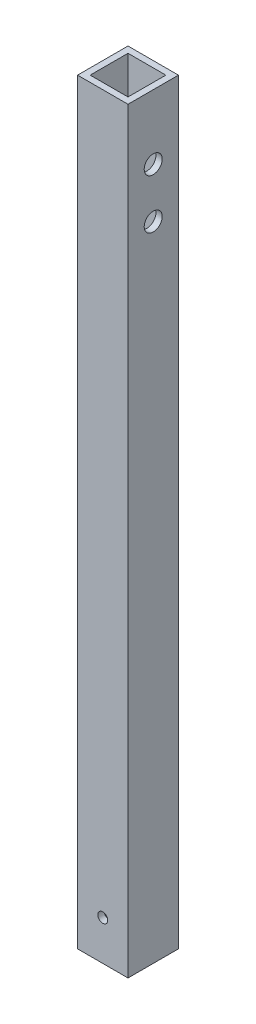
ISO-10303-21;
HEADER;
FILE_DESCRIPTION(('STEP AP214'),'2;1');
FILE_NAME('part.step','',(''),(''),'','','');
FILE_SCHEMA(('AUTOMOTIVE_DESIGN { 1 0 10303 214 1 1 1 1 }'));
ENDSEC;
DATA;
#1=APPLICATION_CONTEXT('core data for automotive mechanical design processes');
#2=APPLICATION_PROTOCOL_DEFINITION('international standard','automotive_design',2000,#1);
#3=PRODUCT_CONTEXT('',#1,'mechanical');
#4=PRODUCT('Part','Part','',(#3));
#5=PRODUCT_RELATED_PRODUCT_CATEGORY('part','',(#4));
#6=PRODUCT_DEFINITION_FORMATION('','',#4);
#7=PRODUCT_DEFINITION_CONTEXT('part definition',#1,'design');
#8=PRODUCT_DEFINITION('design','',#6,#7);
#9=PRODUCT_DEFINITION_SHAPE('','',#8);
#10=(LENGTH_UNIT() NAMED_UNIT(*) SI_UNIT(.MILLI.,.METRE.));
#11=(NAMED_UNIT(*) PLANE_ANGLE_UNIT() SI_UNIT($,.RADIAN.));
#12=(NAMED_UNIT(*) SI_UNIT($,.STERADIAN.) SOLID_ANGLE_UNIT());
#13=UNCERTAINTY_MEASURE_WITH_UNIT(LENGTH_MEASURE(1.E-05),#10,'distance_accuracy_value','');
#14=(GEOMETRIC_REPRESENTATION_CONTEXT(3) GLOBAL_UNCERTAINTY_ASSIGNED_CONTEXT((#13)) GLOBAL_UNIT_ASSIGNED_CONTEXT((#10,
#11,#12)) REPRESENTATION_CONTEXT('',''));
#15=CARTESIAN_POINT('',(0.,0.,0.));
#16=DIRECTION('',(0.,0.,1.));
#17=DIRECTION('',(1.,0.,0.));
#18=AXIS2_PLACEMENT_3D('',#15,#16,#17);
#19=CARTESIAN_POINT('',(0.,381.,0.));
#20=DIRECTION('',(0.,1.,0.));
#21=DIRECTION('',(0.,0.,1.));
#22=AXIS2_PLACEMENT_3D('',#19,#20,#21);
#23=PLANE('',#22);
#24=DIRECTION('',(0.,0.,-1.));
#25=VECTOR('',#24,1.);
#26=CARTESIAN_POINT('',(12.7,381.,-12.7));
#27=LINE('',#26,#25);
#28=CARTESIAN_POINT('',(12.7,381.,12.7));
#29=VERTEX_POINT('',#28);
#30=CARTESIAN_POINT('',(12.7,381.,-12.7));
#31=VERTEX_POINT('',#30);
#32=EDGE_CURVE('E138',#29,#31,#27,.T.);
#33=ORIENTED_EDGE('',*,*,#32,.T.);
#34=DIRECTION('',(-1.,0.,0.));
#35=VECTOR('',#34,1.);
#36=CARTESIAN_POINT('',(-12.7,381.,-12.7));
#37=LINE('',#36,#35);
#38=CARTESIAN_POINT('',(-12.7,381.,-12.7));
#39=VERTEX_POINT('',#38);
#40=EDGE_CURVE('E141',#31,#39,#37,.T.);
#41=ORIENTED_EDGE('',*,*,#40,.T.);
#42=DIRECTION('',(0.,0.,1.));
#43=VECTOR('',#42,1.);
#44=CARTESIAN_POINT('',(-12.7,381.,-12.7));
#45=LINE('',#44,#43);
#46=CARTESIAN_POINT('',(-12.7,381.,12.7));
#47=VERTEX_POINT('',#46);
#48=EDGE_CURVE('E144',#39,#47,#45,.T.);
#49=ORIENTED_EDGE('',*,*,#48,.T.);
#50=DIRECTION('',(1.,0.,0.));
#51=VECTOR('',#50,1.);
#52=CARTESIAN_POINT('',(-12.7,381.,12.7));
#53=LINE('',#52,#51);
#54=EDGE_CURVE('E146',#47,#29,#53,.T.);
#55=ORIENTED_EDGE('',*,*,#54,.T.);
#56=EDGE_LOOP('',(#33,#41,#49,#55));
#57=FACE_BOUND('',#56,.T.);
#58=DIRECTION('',(0.,0.,1.));
#59=VECTOR('',#58,1.);
#60=CARTESIAN_POINT('',(-9.525,381.,-9.525));
#61=LINE('',#60,#59);
#62=CARTESIAN_POINT('',(-9.525,381.,-9.525));
#63=VERTEX_POINT('',#62);
#64=CARTESIAN_POINT('',(-9.525,381.,9.525));
#65=VERTEX_POINT('',#64);
#66=EDGE_CURVE('E108',#63,#65,#61,.T.);
#67=ORIENTED_EDGE('',*,*,#66,.F.);
#68=DIRECTION('',(-1.,0.,0.));
#69=VECTOR('',#68,1.);
#70=CARTESIAN_POINT('',(-9.525,381.,-9.525));
#71=LINE('',#70,#69);
#72=CARTESIAN_POINT('',(9.525,381.,-9.525));
#73=VERTEX_POINT('',#72);
#74=EDGE_CURVE('E100',#73,#63,#71,.T.);
#75=ORIENTED_EDGE('',*,*,#74,.F.);
#76=DIRECTION('',(0.,0.,-1.));
#77=VECTOR('',#76,1.);
#78=CARTESIAN_POINT('',(9.525,381.,-9.525));
#79=LINE('',#78,#77);
#80=CARTESIAN_POINT('',(9.525,381.,9.525));
#81=VERTEX_POINT('',#80);
#82=EDGE_CURVE('E122',#81,#73,#79,.T.);
#83=ORIENTED_EDGE('',*,*,#82,.F.);
#84=DIRECTION('',(1.,0.,0.));
#85=VECTOR('',#84,1.);
#86=CARTESIAN_POINT('',(-9.525,381.,9.525));
#87=LINE('',#86,#85);
#88=EDGE_CURVE('E120',#65,#81,#87,.T.);
#89=ORIENTED_EDGE('',*,*,#88,.F.);
#90=EDGE_LOOP('',(#67,#75,#83,#89));
#91=FACE_BOUND('',#90,.T.);
#92=ADVANCED_FACE('F33',(#57,#91),#23,.T.);
#93=CARTESIAN_POINT('',(0.,0.,0.));
#94=DIRECTION('',(0.,1.,0.));
#95=DIRECTION('',(0.,0.,1.));
#96=AXIS2_PLACEMENT_3D('',#93,#94,#95);
#97=PLANE('',#96);
#98=DIRECTION('',(0.,0.,-1.));
#99=VECTOR('',#98,1.);
#100=CARTESIAN_POINT('',(12.7,0.,-12.7));
#101=LINE('',#100,#99);
#102=CARTESIAN_POINT('',(12.7,0.,12.7));
#103=VERTEX_POINT('',#102);
#104=CARTESIAN_POINT('',(12.7,0.,-12.7));
#105=VERTEX_POINT('',#104);
#106=EDGE_CURVE('E116',#103,#105,#101,.T.);
#107=ORIENTED_EDGE('',*,*,#106,.F.);
#108=DIRECTION('',(1.,0.,0.));
#109=VECTOR('',#108,1.);
#110=CARTESIAN_POINT('',(-12.7,0.,12.7));
#111=LINE('',#110,#109);
#112=CARTESIAN_POINT('',(-12.7,0.,12.7));
#113=VERTEX_POINT('',#112);
#114=EDGE_CURVE('E142',#113,#103,#111,.T.);
#115=ORIENTED_EDGE('',*,*,#114,.F.);
#116=DIRECTION('',(0.,0.,1.));
#117=VECTOR('',#116,1.);
#118=CARTESIAN_POINT('',(-12.7,0.,-12.7));
#119=LINE('',#118,#117);
#120=CARTESIAN_POINT('',(-12.7,0.,-12.7));
#121=VERTEX_POINT('',#120);
#122=EDGE_CURVE('E153',#121,#113,#119,.T.);
#123=ORIENTED_EDGE('',*,*,#122,.F.);
#124=DIRECTION('',(-1.,0.,0.));
#125=VECTOR('',#124,1.);
#126=CARTESIAN_POINT('',(-12.7,0.,-12.7));
#127=LINE('',#126,#125);
#128=EDGE_CURVE('E151',#105,#121,#127,.T.);
#129=ORIENTED_EDGE('',*,*,#128,.F.);
#130=EDGE_LOOP('',(#107,#115,#123,#129));
#131=FACE_BOUND('',#130,.T.);
#132=DIRECTION('',(-1.,0.,0.));
#133=VECTOR('',#132,1.);
#134=CARTESIAN_POINT('',(-9.525,0.,-9.525));
#135=LINE('',#134,#133);
#136=CARTESIAN_POINT('',(9.525,0.,-9.525));
#137=VERTEX_POINT('',#136);
#138=CARTESIAN_POINT('',(-9.525,0.,-9.525));
#139=VERTEX_POINT('',#138);
#140=EDGE_CURVE('E58',#137,#139,#135,.T.);
#141=ORIENTED_EDGE('',*,*,#140,.T.);
#142=DIRECTION('',(0.,0.,1.));
#143=VECTOR('',#142,1.);
#144=CARTESIAN_POINT('',(-9.525,0.,-9.525));
#145=LINE('',#144,#143);
#146=CARTESIAN_POINT('',(-9.525,0.,9.525));
#147=VERTEX_POINT('',#146);
#148=EDGE_CURVE('E115',#139,#147,#145,.T.);
#149=ORIENTED_EDGE('',*,*,#148,.T.);
#150=DIRECTION('',(1.,0.,0.));
#151=VECTOR('',#150,1.);
#152=CARTESIAN_POINT('',(-9.525,0.,9.525));
#153=LINE('',#152,#151);
#154=CARTESIAN_POINT('',(9.525,0.,9.525));
#155=VERTEX_POINT('',#154);
#156=EDGE_CURVE('E130',#147,#155,#153,.T.);
#157=ORIENTED_EDGE('',*,*,#156,.T.);
#158=DIRECTION('',(0.,0.,-1.));
#159=VECTOR('',#158,1.);
#160=CARTESIAN_POINT('',(9.525,0.,-9.525));
#161=LINE('',#160,#159);
#162=EDGE_CURVE('E109',#155,#137,#161,.T.);
#163=ORIENTED_EDGE('',*,*,#162,.T.);
#164=EDGE_LOOP('',(#141,#149,#157,#163));
#165=FACE_BOUND('',#164,.T.);
#166=ADVANCED_FACE('F216',(#131,#165),#97,.F.);
#167=CARTESIAN_POINT('',(12.7,381.,-12.7));
#168=DIRECTION('',(-1.,0.,0.));
#169=DIRECTION('',(0.,0.,1.));
#170=AXIS2_PLACEMENT_3D('',#167,#168,#169);
#171=PLANE('',#170);
#172=CARTESIAN_POINT('',(12.7,348.5,0.));
#173=DIRECTION('',(-1.,0.,0.));
#174=DIRECTION('',(0.,0.,1.));
#175=AXIS2_PLACEMENT_3D('',#172,#173,#174);
#176=CIRCLE('',#175,4.53916648764621);
#177=CARTESIAN_POINT('',(12.7,348.5,4.53916648764621));
#178=VERTEX_POINT('',#177);
#179=EDGE_CURVE('E169',#178,#178,#176,.T.);
#180=ORIENTED_EDGE('',*,*,#179,.T.);
#181=EDGE_LOOP('',(#180));
#182=FACE_BOUND('',#181,.T.);
#183=CARTESIAN_POINT('',(12.7,323.5,0.));
#184=DIRECTION('',(-1.,0.,0.));
#185=DIRECTION('',(0.,0.,1.));
#186=AXIS2_PLACEMENT_3D('',#183,#184,#185);
#187=CIRCLE('',#186,4.53916648764621);
#188=CARTESIAN_POINT('',(12.7,323.5,4.53916648764621));
#189=VERTEX_POINT('',#188);
#190=EDGE_CURVE('E180',#189,#189,#187,.T.);
#191=ORIENTED_EDGE('',*,*,#190,.T.);
#192=EDGE_LOOP('',(#191));
#193=FACE_BOUND('',#192,.T.);
#194=ORIENTED_EDGE('',*,*,#106,.T.);
#195=DIRECTION('',(0.,-1.,0.));
#196=VECTOR('',#195,1.);
#197=CARTESIAN_POINT('',(12.7,381.,-12.7));
#198=LINE('',#197,#196);
#199=EDGE_CURVE('E11',#31,#105,#198,.T.);
#200=ORIENTED_EDGE('',*,*,#199,.F.);
#201=ORIENTED_EDGE('',*,*,#32,.F.);
#202=DIRECTION('',(0.,-1.,0.));
#203=VECTOR('',#202,1.);
#204=CARTESIAN_POINT('',(12.7,381.,12.7));
#205=LINE('',#204,#203);
#206=EDGE_CURVE('E148',#29,#103,#205,.T.);
#207=ORIENTED_EDGE('',*,*,#206,.T.);
#208=EDGE_LOOP('',(#194,#200,#201,#207));
#209=FACE_BOUND('',#208,.T.);
#210=ADVANCED_FACE('F35',(#182,#193,#209),#171,.F.);
#211=CARTESIAN_POINT('',(-12.7,381.,-12.7));
#212=DIRECTION('',(0.,0.,1.));
#213=DIRECTION('',(1.,0.,0.));
#214=AXIS2_PLACEMENT_3D('',#211,#212,#213);
#215=PLANE('',#214);
#216=CARTESIAN_POINT('',(0.,20.,-12.7));
#217=DIRECTION('',(0.,0.,-1.));
#218=DIRECTION('',(-1.,0.,0.));
#219=AXIS2_PLACEMENT_3D('',#216,#217,#218);
#220=CIRCLE('',#219,2.5);
#221=CARTESIAN_POINT('',(-2.5,20.,-12.7));
#222=VERTEX_POINT('',#221);
#223=EDGE_CURVE('E191',#222,#222,#220,.T.);
#224=ORIENTED_EDGE('',*,*,#223,.F.);
#225=EDGE_LOOP('',(#224));
#226=FACE_BOUND('',#225,.T.);
#227=ORIENTED_EDGE('',*,*,#128,.T.);
#228=DIRECTION('',(0.,-1.,0.));
#229=VECTOR('',#228,1.);
#230=CARTESIAN_POINT('',(-12.7,381.,-12.7));
#231=LINE('',#230,#229);
#232=EDGE_CURVE('E42',#39,#121,#231,.T.);
#233=ORIENTED_EDGE('',*,*,#232,.F.);
#234=ORIENTED_EDGE('',*,*,#40,.F.);
#235=ORIENTED_EDGE('',*,*,#199,.T.);
#236=EDGE_LOOP('',(#227,#233,#234,#235));
#237=FACE_BOUND('',#236,.T.);
#238=ADVANCED_FACE('F225',(#226,#237),#215,.F.);
#239=CARTESIAN_POINT('',(-12.7,381.,-12.7));
#240=DIRECTION('',(1.,0.,0.));
#241=DIRECTION('',(0.,0.,-1.));
#242=AXIS2_PLACEMENT_3D('',#239,#240,#241);
#243=PLANE('',#242);
#244=CARTESIAN_POINT('',(-12.7,348.5,0.));
#245=DIRECTION('',(-1.,0.,0.));
#246=DIRECTION('',(0.,0.,1.));
#247=AXIS2_PLACEMENT_3D('',#244,#245,#246);
#248=CIRCLE('',#247,4.53916648764621);
#249=CARTESIAN_POINT('',(-12.7,348.5,4.53916648764622));
#250=VERTEX_POINT('',#249);
#251=EDGE_CURVE('E175',#250,#250,#248,.T.);
#252=ORIENTED_EDGE('',*,*,#251,.F.);
#253=EDGE_LOOP('',(#252));
#254=FACE_BOUND('',#253,.T.);
#255=CARTESIAN_POINT('',(-12.7,323.5,0.));
#256=DIRECTION('',(-1.,0.,0.));
#257=DIRECTION('',(0.,0.,1.));
#258=AXIS2_PLACEMENT_3D('',#255,#256,#257);
#259=CIRCLE('',#258,4.53916648764621);
#260=CARTESIAN_POINT('',(-12.7,323.5,4.53916648764622));
#261=VERTEX_POINT('',#260);
#262=EDGE_CURVE('E185',#261,#261,#259,.T.);
#263=ORIENTED_EDGE('',*,*,#262,.F.);
#264=EDGE_LOOP('',(#263));
#265=FACE_BOUND('',#264,.T.);
#266=ORIENTED_EDGE('',*,*,#122,.T.);
#267=DIRECTION('',(0.,-1.,0.));
#268=VECTOR('',#267,1.);
#269=CARTESIAN_POINT('',(-12.7,381.,12.7));
#270=LINE('',#269,#268);
#271=EDGE_CURVE('E158',#47,#113,#270,.T.);
#272=ORIENTED_EDGE('',*,*,#271,.F.);
#273=ORIENTED_EDGE('',*,*,#48,.F.);
#274=ORIENTED_EDGE('',*,*,#232,.T.);
#275=EDGE_LOOP('',(#266,#272,#273,#274));
#276=FACE_BOUND('',#275,.T.);
#277=ADVANCED_FACE('F211',(#254,#265,#276),#243,.F.);
#278=CARTESIAN_POINT('',(-12.7,381.,12.7));
#279=DIRECTION('',(0.,0.,-1.));
#280=DIRECTION('',(-1.,0.,0.));
#281=AXIS2_PLACEMENT_3D('',#278,#279,#280);
#282=PLANE('',#281);
#283=CARTESIAN_POINT('',(0.,20.,12.7));
#284=DIRECTION('',(0.,0.,-1.));
#285=DIRECTION('',(-1.,0.,0.));
#286=AXIS2_PLACEMENT_3D('',#283,#284,#285);
#287=CIRCLE('',#286,2.5);
#288=CARTESIAN_POINT('',(-2.5,20.,12.7));
#289=VERTEX_POINT('',#288);
#290=EDGE_CURVE('E165',#289,#289,#287,.T.);
#291=ORIENTED_EDGE('',*,*,#290,.T.);
#292=EDGE_LOOP('',(#291));
#293=FACE_BOUND('',#292,.T.);
#294=ORIENTED_EDGE('',*,*,#114,.T.);
#295=ORIENTED_EDGE('',*,*,#206,.F.);
#296=ORIENTED_EDGE('',*,*,#54,.F.);
#297=ORIENTED_EDGE('',*,*,#271,.T.);
#298=EDGE_LOOP('',(#294,#295,#296,#297));
#299=FACE_BOUND('',#298,.T.);
#300=ADVANCED_FACE('F202',(#293,#299),#282,.F.);
#301=CARTESIAN_POINT('',(-9.525,381.,-9.525));
#302=DIRECTION('',(0.,0.,1.));
#303=DIRECTION('',(1.,0.,0.));
#304=AXIS2_PLACEMENT_3D('',#301,#302,#303);
#305=PLANE('',#304);
#306=CARTESIAN_POINT('',(0.,20.,-9.525));
#307=DIRECTION('',(0.,0.,1.));
#308=DIRECTION('',(1.,0.,0.));
#309=AXIS2_PLACEMENT_3D('',#306,#307,#308);
#310=CIRCLE('',#309,2.5);
#311=CARTESIAN_POINT('',(2.5,20.,-9.525));
#312=VERTEX_POINT('',#311);
#313=EDGE_CURVE('E128',#312,#312,#310,.T.);
#314=ORIENTED_EDGE('',*,*,#313,.F.);
#315=EDGE_LOOP('',(#314));
#316=FACE_BOUND('',#315,.T.);
#317=ORIENTED_EDGE('',*,*,#140,.F.);
#318=DIRECTION('',(0.,-1.,0.));
#319=VECTOR('',#318,1.);
#320=CARTESIAN_POINT('',(9.525,381.,-9.525));
#321=LINE('',#320,#319);
#322=EDGE_CURVE('E104',#73,#137,#321,.T.);
#323=ORIENTED_EDGE('',*,*,#322,.F.);
#324=ORIENTED_EDGE('',*,*,#74,.T.);
#325=DIRECTION('',(0.,-1.,0.));
#326=VECTOR('',#325,1.);
#327=CARTESIAN_POINT('',(-9.525,381.,-9.525));
#328=LINE('',#327,#326);
#329=EDGE_CURVE('E103',#63,#139,#328,.T.);
#330=ORIENTED_EDGE('',*,*,#329,.T.);
#331=EDGE_LOOP('',(#317,#323,#324,#330));
#332=FACE_BOUND('',#331,.T.);
#333=ADVANCED_FACE('F102',(#316,#332),#305,.T.);
#334=CARTESIAN_POINT('',(-9.525,381.,-9.525));
#335=DIRECTION('',(1.,0.,0.));
#336=DIRECTION('',(0.,0.,-1.));
#337=AXIS2_PLACEMENT_3D('',#334,#335,#336);
#338=PLANE('',#337);
#339=CARTESIAN_POINT('',(-9.525,348.5,0.));
#340=DIRECTION('',(1.,0.,0.));
#341=DIRECTION('',(0.,0.,-1.));
#342=AXIS2_PLACEMENT_3D('',#339,#340,#341);
#343=CIRCLE('',#342,4.53916648764621);
#344=CARTESIAN_POINT('',(-9.525,348.5,-4.53916648764621));
#345=VERTEX_POINT('',#344);
#346=EDGE_CURVE('E188',#345,#345,#343,.T.);
#347=ORIENTED_EDGE('',*,*,#346,.F.);
#348=EDGE_LOOP('',(#347));
#349=FACE_BOUND('',#348,.T.);
#350=CARTESIAN_POINT('',(-9.525,323.5,0.));
#351=DIRECTION('',(1.,0.,0.));
#352=DIRECTION('',(0.,0.,-1.));
#353=AXIS2_PLACEMENT_3D('',#350,#351,#352);
#354=CIRCLE('',#353,4.53916648764621);
#355=CARTESIAN_POINT('',(-9.525,323.5,-4.53916648764621));
#356=VERTEX_POINT('',#355);
#357=EDGE_CURVE('E168',#356,#356,#354,.T.);
#358=ORIENTED_EDGE('',*,*,#357,.F.);
#359=EDGE_LOOP('',(#358));
#360=FACE_BOUND('',#359,.T.);
#361=ORIENTED_EDGE('',*,*,#148,.F.);
#362=ORIENTED_EDGE('',*,*,#329,.F.);
#363=ORIENTED_EDGE('',*,*,#66,.T.);
#364=DIRECTION('',(0.,-1.,0.));
#365=VECTOR('',#364,1.);
#366=CARTESIAN_POINT('',(-9.525,381.,9.525));
#367=LINE('',#366,#365);
#368=EDGE_CURVE('E117',#65,#147,#367,.T.);
#369=ORIENTED_EDGE('',*,*,#368,.T.);
#370=EDGE_LOOP('',(#361,#362,#363,#369));
#371=FACE_BOUND('',#370,.T.);
#372=ADVANCED_FACE('F112',(#349,#360,#371),#338,.T.);
#373=CARTESIAN_POINT('',(-9.525,381.,9.525));
#374=DIRECTION('',(0.,0.,-1.));
#375=DIRECTION('',(-1.,0.,0.));
#376=AXIS2_PLACEMENT_3D('',#373,#374,#375);
#377=PLANE('',#376);
#378=CARTESIAN_POINT('',(0.,20.,9.525));
#379=DIRECTION('',(0.,0.,-1.));
#380=DIRECTION('',(-1.,0.,0.));
#381=AXIS2_PLACEMENT_3D('',#378,#379,#380);
#382=CIRCLE('',#381,2.5);
#383=CARTESIAN_POINT('',(-2.5,20.,9.525));
#384=VERTEX_POINT('',#383);
#385=EDGE_CURVE('E163',#384,#384,#382,.T.);
#386=ORIENTED_EDGE('',*,*,#385,.F.);
#387=EDGE_LOOP('',(#386));
#388=FACE_BOUND('',#387,.T.);
#389=ORIENTED_EDGE('',*,*,#156,.F.);
#390=ORIENTED_EDGE('',*,*,#368,.F.);
#391=ORIENTED_EDGE('',*,*,#88,.T.);
#392=DIRECTION('',(0.,-1.,0.));
#393=VECTOR('',#392,1.);
#394=CARTESIAN_POINT('',(9.525,381.,9.525));
#395=LINE('',#394,#393);
#396=EDGE_CURVE('E50',#81,#155,#395,.T.);
#397=ORIENTED_EDGE('',*,*,#396,.T.);
#398=EDGE_LOOP('',(#389,#390,#391,#397));
#399=FACE_BOUND('',#398,.T.);
#400=ADVANCED_FACE('F208',(#388,#399),#377,.T.);
#401=CARTESIAN_POINT('',(9.525,381.,-9.525));
#402=DIRECTION('',(-1.,0.,0.));
#403=DIRECTION('',(0.,0.,1.));
#404=AXIS2_PLACEMENT_3D('',#401,#402,#403);
#405=PLANE('',#404);
#406=CARTESIAN_POINT('',(9.525,348.5,0.));
#407=DIRECTION('',(-1.,0.,0.));
#408=DIRECTION('',(0.,0.,1.));
#409=AXIS2_PLACEMENT_3D('',#406,#407,#408);
#410=CIRCLE('',#409,4.53916648764621);
#411=CARTESIAN_POINT('',(9.525,348.5,4.53916648764621));
#412=VERTEX_POINT('',#411);
#413=EDGE_CURVE('E37',#412,#412,#410,.T.);
#414=ORIENTED_EDGE('',*,*,#413,.F.);
#415=EDGE_LOOP('',(#414));
#416=FACE_BOUND('',#415,.T.);
#417=CARTESIAN_POINT('',(9.525,323.5,0.));
#418=DIRECTION('',(-1.,0.,0.));
#419=DIRECTION('',(0.,0.,1.));
#420=AXIS2_PLACEMENT_3D('',#417,#418,#419);
#421=CIRCLE('',#420,4.53916648764621);
#422=CARTESIAN_POINT('',(9.525,323.5,4.53916648764621));
#423=VERTEX_POINT('',#422);
#424=EDGE_CURVE('E166',#423,#423,#421,.T.);
#425=ORIENTED_EDGE('',*,*,#424,.F.);
#426=EDGE_LOOP('',(#425));
#427=FACE_BOUND('',#426,.T.);
#428=ORIENTED_EDGE('',*,*,#162,.F.);
#429=ORIENTED_EDGE('',*,*,#396,.F.);
#430=ORIENTED_EDGE('',*,*,#82,.T.);
#431=ORIENTED_EDGE('',*,*,#322,.T.);
#432=EDGE_LOOP('',(#428,#429,#430,#431));
#433=FACE_BOUND('',#432,.T.);
#434=ADVANCED_FACE('F249',(#416,#427,#433),#405,.T.);
#435=CARTESIAN_POINT('',(0.,20.,12.7));
#436=DIRECTION('',(0.,0.,-1.));
#437=DIRECTION('',(-1.,0.,0.));
#438=AXIS2_PLACEMENT_3D('',#435,#436,#437);
#439=CYLINDRICAL_SURFACE('',#438,2.5);
#440=ORIENTED_EDGE('',*,*,#385,.T.);
#441=EDGE_LOOP('',(#440));
#442=FACE_BOUND('',#441,.T.);
#443=ORIENTED_EDGE('',*,*,#290,.F.);
#444=EDGE_LOOP('',(#443));
#445=FACE_BOUND('',#444,.T.);
#446=ADVANCED_FACE('F251',(#442,#445),#439,.F.);
#447=ORIENTED_EDGE('',*,*,#313,.T.);
#448=EDGE_LOOP('',(#447));
#449=FACE_BOUND('',#448,.T.);
#450=ORIENTED_EDGE('',*,*,#223,.T.);
#451=EDGE_LOOP('',(#450));
#452=FACE_BOUND('',#451,.T.);
#453=ADVANCED_FACE('F198',(#449,#452),#439,.F.);
#454=CARTESIAN_POINT('',(12.7,323.5,0.));
#455=DIRECTION('',(-1.,0.,0.));
#456=DIRECTION('',(0.,0.,1.));
#457=AXIS2_PLACEMENT_3D('',#454,#455,#456);
#458=CYLINDRICAL_SURFACE('',#457,4.53916648764621);
#459=ORIENTED_EDGE('',*,*,#424,.T.);
#460=EDGE_LOOP('',(#459));
#461=FACE_BOUND('',#460,.T.);
#462=ORIENTED_EDGE('',*,*,#190,.F.);
#463=EDGE_LOOP('',(#462));
#464=FACE_BOUND('',#463,.T.);
#465=ADVANCED_FACE('F265',(#461,#464),#458,.F.);
#466=CARTESIAN_POINT('',(12.7,348.5,0.));
#467=DIRECTION('',(-1.,0.,0.));
#468=DIRECTION('',(0.,0.,1.));
#469=AXIS2_PLACEMENT_3D('',#466,#467,#468);
#470=CYLINDRICAL_SURFACE('',#469,4.53916648764621);
#471=ORIENTED_EDGE('',*,*,#413,.T.);
#472=EDGE_LOOP('',(#471));
#473=FACE_BOUND('',#472,.T.);
#474=ORIENTED_EDGE('',*,*,#179,.F.);
#475=EDGE_LOOP('',(#474));
#476=FACE_BOUND('',#475,.T.);
#477=ADVANCED_FACE('F268',(#473,#476),#470,.F.);
#478=ORIENTED_EDGE('',*,*,#357,.T.);
#479=EDGE_LOOP('',(#478));
#480=FACE_BOUND('',#479,.T.);
#481=ORIENTED_EDGE('',*,*,#262,.T.);
#482=EDGE_LOOP('',(#481));
#483=FACE_BOUND('',#482,.T.);
#484=ADVANCED_FACE('F269',(#480,#483),#458,.F.);
#485=ORIENTED_EDGE('',*,*,#346,.T.);
#486=EDGE_LOOP('',(#485));
#487=FACE_BOUND('',#486,.T.);
#488=ORIENTED_EDGE('',*,*,#251,.T.);
#489=EDGE_LOOP('',(#488));
#490=FACE_BOUND('',#489,.T.);
#491=ADVANCED_FACE('F272',(#487,#490),#470,.F.);
#492=CLOSED_SHELL('',(#92,#166,#210,#238,#277,#300,#333,#372,#400,#434,#446,#453,#465,#477,#484,#491));
#493=MANIFOLD_SOLID_BREP('B2',#492);
#494=ADVANCED_BREP_SHAPE_REPRESENTATION('',(#18,#493),#14);
#495=SHAPE_DEFINITION_REPRESENTATION(#9,#494);
ENDSEC;
END-ISO-10303-21;
